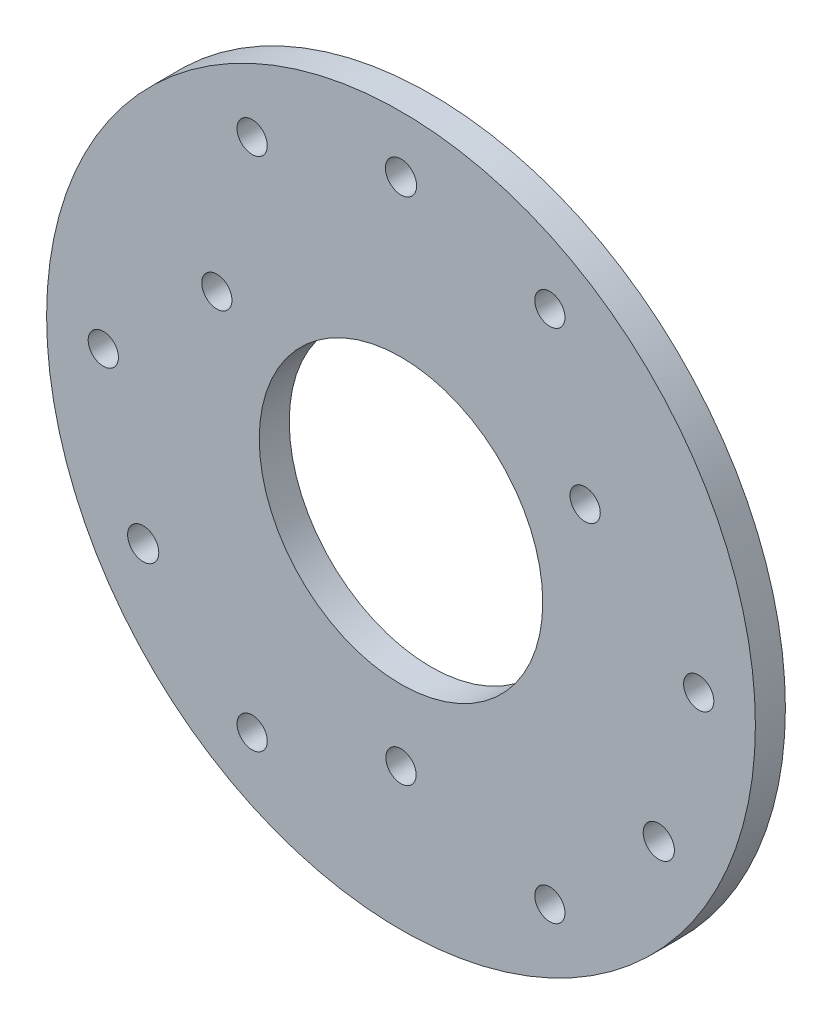
ISO-10303-21;
HEADER;
FILE_DESCRIPTION(('STEP AP214'),'2;1');
FILE_NAME('part.step','',(''),(''),'','','');
FILE_SCHEMA(('AUTOMOTIVE_DESIGN { 1 0 10303 214 1 1 1 1 }'));
ENDSEC;
DATA;
#1=APPLICATION_CONTEXT('core data for automotive mechanical design processes');
#2=APPLICATION_PROTOCOL_DEFINITION('international standard','automotive_design',2000,#1);
#3=PRODUCT_CONTEXT('',#1,'mechanical');
#4=PRODUCT('Part','Part','',(#3));
#5=PRODUCT_RELATED_PRODUCT_CATEGORY('part','',(#4));
#6=PRODUCT_DEFINITION_FORMATION('','',#4);
#7=PRODUCT_DEFINITION_CONTEXT('part definition',#1,'design');
#8=PRODUCT_DEFINITION('design','',#6,#7);
#9=PRODUCT_DEFINITION_SHAPE('','',#8);
#10=(LENGTH_UNIT() NAMED_UNIT(*) SI_UNIT(.MILLI.,.METRE.));
#11=(NAMED_UNIT(*) PLANE_ANGLE_UNIT() SI_UNIT($,.RADIAN.));
#12=(NAMED_UNIT(*) SI_UNIT($,.STERADIAN.) SOLID_ANGLE_UNIT());
#13=UNCERTAINTY_MEASURE_WITH_UNIT(LENGTH_MEASURE(1.E-05),#10,'distance_accuracy_value','');
#14=(GEOMETRIC_REPRESENTATION_CONTEXT(3) GLOBAL_UNCERTAINTY_ASSIGNED_CONTEXT((#13)) GLOBAL_UNIT_ASSIGNED_CONTEXT((#10,
#11,#12)) REPRESENTATION_CONTEXT('',''));
#15=CARTESIAN_POINT('',(0.,0.,0.));
#16=DIRECTION('',(0.,0.,1.));
#17=DIRECTION('',(1.,0.,0.));
#18=AXIS2_PLACEMENT_3D('',#15,#16,#17);
#19=CARTESIAN_POINT('',(0.,0.,4.175));
#20=DIRECTION('',(0.,0.,1.));
#21=DIRECTION('',(1.,0.,0.));
#22=AXIS2_PLACEMENT_3D('',#19,#20,#21);
#23=PLANE('',#22);
#24=CARTESIAN_POINT('',(-15.75,-27.2798002192098,4.175));
#25=DIRECTION('',(0.,0.,1.));
#26=DIRECTION('',(1.,0.,0.));
#27=AXIS2_PLACEMENT_3D('',#24,#25,#26);
#28=CIRCLE('',#27,1.6);
#29=CARTESIAN_POINT('',(-14.15,-27.2798002192098,4.175));
#30=VERTEX_POINT('',#29);
#31=EDGE_CURVE('E53',#30,#30,#28,.T.);
#32=ORIENTED_EDGE('',*,*,#31,.F.);
#33=EDGE_LOOP('',(#32));
#34=FACE_BOUND('',#33,.T.);
#35=CARTESIAN_POINT('',(-31.5,0.,4.175));
#36=DIRECTION('',(0.,0.,1.));
#37=DIRECTION('',(1.,0.,0.));
#38=AXIS2_PLACEMENT_3D('',#35,#36,#37);
#39=CIRCLE('',#38,1.6);
#40=CARTESIAN_POINT('',(-29.9,0.,4.175));
#41=VERTEX_POINT('',#40);
#42=EDGE_CURVE('E140',#41,#41,#39,.T.);
#43=ORIENTED_EDGE('',*,*,#42,.F.);
#44=EDGE_LOOP('',(#43));
#45=FACE_BOUND('',#44,.T.);
#46=CARTESIAN_POINT('',(-15.7499999999998,27.2798002192099,4.175));
#47=DIRECTION('',(0.,0.,1.));
#48=DIRECTION('',(1.,0.,0.));
#49=AXIS2_PLACEMENT_3D('',#46,#47,#48);
#50=CIRCLE('',#49,1.6);
#51=CARTESIAN_POINT('',(-14.1499999999998,27.2798002192099,4.175));
#52=VERTEX_POINT('',#51);
#53=EDGE_CURVE('E144',#52,#52,#50,.T.);
#54=ORIENTED_EDGE('',*,*,#53,.F.);
#55=EDGE_LOOP('',(#54));
#56=FACE_BOUND('',#55,.T.);
#57=CARTESIAN_POINT('',(15.7500000000002,27.2798002192097,4.175));
#58=DIRECTION('',(0.,0.,1.));
#59=DIRECTION('',(1.,0.,0.));
#60=AXIS2_PLACEMENT_3D('',#57,#58,#59);
#61=CIRCLE('',#60,1.6);
#62=CARTESIAN_POINT('',(17.3500000000002,27.2798002192097,4.175));
#63=VERTEX_POINT('',#62);
#64=EDGE_CURVE('E148',#63,#63,#61,.T.);
#65=ORIENTED_EDGE('',*,*,#64,.F.);
#66=EDGE_LOOP('',(#65));
#67=FACE_BOUND('',#66,.T.);
#68=CARTESIAN_POINT('',(31.5,-3.22658566531686E-13,4.175));
#69=DIRECTION('',(0.,0.,1.));
#70=DIRECTION('',(1.,0.,0.));
#71=AXIS2_PLACEMENT_3D('',#68,#69,#70);
#72=CIRCLE('',#71,1.6);
#73=CARTESIAN_POINT('',(33.1,-3.22658566531686E-13,4.175));
#74=VERTEX_POINT('',#73);
#75=EDGE_CURVE('E152',#74,#74,#72,.T.);
#76=ORIENTED_EDGE('',*,*,#75,.F.);
#77=EDGE_LOOP('',(#76));
#78=FACE_BOUND('',#77,.T.);
#79=CARTESIAN_POINT('',(15.75,-27.2798002192098,4.175));
#80=DIRECTION('',(0.,0.,1.));
#81=DIRECTION('',(1.,0.,0.));
#82=AXIS2_PLACEMENT_3D('',#79,#80,#81);
#83=CIRCLE('',#82,1.6);
#84=CARTESIAN_POINT('',(17.35,-27.2798002192098,4.175));
#85=VERTEX_POINT('',#84);
#86=EDGE_CURVE('E156',#85,#85,#83,.T.);
#87=ORIENTED_EDGE('',*,*,#86,.F.);
#88=EDGE_LOOP('',(#87));
#89=FACE_BOUND('',#88,.T.);
#90=CARTESIAN_POINT('',(-19.4855715851498,11.25,4.175));
#91=DIRECTION('',(0.,0.,1.));
#92=DIRECTION('',(1.,0.,0.));
#93=AXIS2_PLACEMENT_3D('',#90,#91,#92);
#94=CIRCLE('',#93,1.6);
#95=CARTESIAN_POINT('',(-17.8855715851498,11.25,4.175));
#96=VERTEX_POINT('',#95);
#97=EDGE_CURVE('E79',#96,#96,#94,.T.);
#98=ORIENTED_EDGE('',*,*,#97,.F.);
#99=EDGE_LOOP('',(#98));
#100=FACE_BOUND('',#99,.T.);
#101=CARTESIAN_POINT('',(0.,-22.5,4.175));
#102=DIRECTION('',(0.,0.,1.));
#103=DIRECTION('',(1.,0.,0.));
#104=AXIS2_PLACEMENT_3D('',#101,#102,#103);
#105=CIRCLE('',#104,1.6);
#106=CARTESIAN_POINT('',(1.59999999999995,-22.5,4.175));
#107=VERTEX_POINT('',#106);
#108=EDGE_CURVE('E91',#107,#107,#105,.T.);
#109=ORIENTED_EDGE('',*,*,#108,.F.);
#110=EDGE_LOOP('',(#109));
#111=FACE_BOUND('',#110,.T.);
#112=CARTESIAN_POINT('',(0.,31.5,4.175));
#113=DIRECTION('',(0.,0.,1.));
#114=DIRECTION('',(1.,0.,0.));
#115=AXIS2_PLACEMENT_3D('',#112,#113,#114);
#116=CIRCLE('',#115,1.65);
#117=CARTESIAN_POINT('',(1.65,31.5,4.175));
#118=VERTEX_POINT('',#117);
#119=EDGE_CURVE('E103',#118,#118,#116,.T.);
#120=ORIENTED_EDGE('',*,*,#119,.F.);
#121=EDGE_LOOP('',(#120));
#122=FACE_BOUND('',#121,.T.);
#123=CARTESIAN_POINT('',(0.,0.,4.175));
#124=DIRECTION('',(0.,0.,1.));
#125=DIRECTION('',(1.,0.,0.));
#126=AXIS2_PLACEMENT_3D('',#123,#124,#125);
#127=CIRCLE('',#126,37.5);
#128=CARTESIAN_POINT('',(37.5,0.,4.175));
#129=VERTEX_POINT('',#128);
#130=EDGE_CURVE('E10',#129,#129,#127,.T.);
#131=ORIENTED_EDGE('',*,*,#130,.T.);
#132=EDGE_LOOP('',(#131));
#133=FACE_BOUND('',#132,.T.);
#134=CARTESIAN_POINT('',(27.2798002192098,-15.75,4.175));
#135=DIRECTION('',(0.,0.,1.));
#136=DIRECTION('',(1.,0.,0.));
#137=AXIS2_PLACEMENT_3D('',#134,#135,#136);
#138=CIRCLE('',#137,1.65);
#139=CARTESIAN_POINT('',(28.9298002192098,-15.75,4.175));
#140=VERTEX_POINT('',#139);
#141=EDGE_CURVE('E43',#140,#140,#138,.T.);
#142=ORIENTED_EDGE('',*,*,#141,.F.);
#143=EDGE_LOOP('',(#142));
#144=FACE_BOUND('',#143,.T.);
#145=CARTESIAN_POINT('',(19.4855715851499,11.25,4.175));
#146=DIRECTION('',(0.,0.,1.));
#147=DIRECTION('',(1.,0.,0.));
#148=AXIS2_PLACEMENT_3D('',#145,#146,#147);
#149=CIRCLE('',#148,1.6);
#150=CARTESIAN_POINT('',(21.0855715851499,11.25,4.175));
#151=VERTEX_POINT('',#150);
#152=EDGE_CURVE('E97',#151,#151,#149,.T.);
#153=ORIENTED_EDGE('',*,*,#152,.F.);
#154=EDGE_LOOP('',(#153));
#155=FACE_BOUND('',#154,.T.);
#156=CARTESIAN_POINT('',(-27.2798002192098,-15.75,4.175));
#157=DIRECTION('',(0.,0.,1.));
#158=DIRECTION('',(1.,0.,0.));
#159=AXIS2_PLACEMENT_3D('',#156,#157,#158);
#160=CIRCLE('',#159,1.65);
#161=CARTESIAN_POINT('',(-25.6298002192098,-15.75,4.175));
#162=VERTEX_POINT('',#161);
#163=EDGE_CURVE('E85',#162,#162,#160,.T.);
#164=ORIENTED_EDGE('',*,*,#163,.F.);
#165=EDGE_LOOP('',(#164));
#166=FACE_BOUND('',#165,.T.);
#167=CARTESIAN_POINT('',(0.,0.,4.175));
#168=DIRECTION('',(0.,0.,1.));
#169=DIRECTION('',(1.,0.,0.));
#170=AXIS2_PLACEMENT_3D('',#167,#168,#169);
#171=CIRCLE('',#170,15.);
#172=CARTESIAN_POINT('',(15.,0.,4.175));
#173=VERTEX_POINT('',#172);
#174=EDGE_CURVE('E70',#173,#173,#171,.T.);
#175=ORIENTED_EDGE('',*,*,#174,.F.);
#176=EDGE_LOOP('',(#175));
#177=FACE_BOUND('',#176,.T.);
#178=ADVANCED_FACE('F30',(#34,#45,#56,#67,#78,#89,#100,#111,#122,#133,#144,#155,#166,#177),#23,.T.);
#179=CARTESIAN_POINT('',(0.,0.,1.));
#180=DIRECTION('',(0.,0.,1.));
#181=DIRECTION('',(1.,0.,0.));
#182=AXIS2_PLACEMENT_3D('',#179,#180,#181);
#183=PLANE('',#182);
#184=CARTESIAN_POINT('',(-15.75,-27.2798002192098,1.));
#185=DIRECTION('',(0.,0.,1.));
#186=DIRECTION('',(1.,0.,0.));
#187=AXIS2_PLACEMENT_3D('',#184,#185,#186);
#188=CIRCLE('',#187,1.6);
#189=CARTESIAN_POINT('',(-14.15,-27.2798002192098,1.));
#190=VERTEX_POINT('',#189);
#191=EDGE_CURVE('E34',#190,#190,#188,.T.);
#192=ORIENTED_EDGE('',*,*,#191,.T.);
#193=EDGE_LOOP('',(#192));
#194=FACE_BOUND('',#193,.T.);
#195=CARTESIAN_POINT('',(-31.5,0.,1.));
#196=DIRECTION('',(0.,0.,1.));
#197=DIRECTION('',(1.,0.,0.));
#198=AXIS2_PLACEMENT_3D('',#195,#196,#197);
#199=CIRCLE('',#198,1.6);
#200=CARTESIAN_POINT('',(-29.9,0.,1.));
#201=VERTEX_POINT('',#200);
#202=EDGE_CURVE('E61',#201,#201,#199,.T.);
#203=ORIENTED_EDGE('',*,*,#202,.T.);
#204=EDGE_LOOP('',(#203));
#205=FACE_BOUND('',#204,.T.);
#206=CARTESIAN_POINT('',(-15.7499999999998,27.2798002192099,1.));
#207=DIRECTION('',(0.,0.,1.));
#208=DIRECTION('',(1.,0.,0.));
#209=AXIS2_PLACEMENT_3D('',#206,#207,#208);
#210=CIRCLE('',#209,1.6);
#211=CARTESIAN_POINT('',(-14.1499999999998,27.2798002192099,1.));
#212=VERTEX_POINT('',#211);
#213=EDGE_CURVE('E59',#212,#212,#210,.T.);
#214=ORIENTED_EDGE('',*,*,#213,.T.);
#215=EDGE_LOOP('',(#214));
#216=FACE_BOUND('',#215,.T.);
#217=CARTESIAN_POINT('',(15.7500000000002,27.2798002192097,1.));
#218=DIRECTION('',(0.,0.,1.));
#219=DIRECTION('',(1.,0.,0.));
#220=AXIS2_PLACEMENT_3D('',#217,#218,#219);
#221=CIRCLE('',#220,1.6);
#222=CARTESIAN_POINT('',(17.3500000000002,27.2798002192097,1.));
#223=VERTEX_POINT('',#222);
#224=EDGE_CURVE('E56',#223,#223,#221,.T.);
#225=ORIENTED_EDGE('',*,*,#224,.T.);
#226=EDGE_LOOP('',(#225));
#227=FACE_BOUND('',#226,.T.);
#228=CARTESIAN_POINT('',(31.5,-3.22658566531686E-13,1.));
#229=DIRECTION('',(0.,0.,1.));
#230=DIRECTION('',(1.,0.,0.));
#231=AXIS2_PLACEMENT_3D('',#228,#229,#230);
#232=CIRCLE('',#231,1.6);
#233=CARTESIAN_POINT('',(33.1,-3.22658566531686E-13,1.));
#234=VERTEX_POINT('',#233);
#235=EDGE_CURVE('E52',#234,#234,#232,.T.);
#236=ORIENTED_EDGE('',*,*,#235,.T.);
#237=EDGE_LOOP('',(#236));
#238=FACE_BOUND('',#237,.T.);
#239=CARTESIAN_POINT('',(15.75,-27.2798002192098,1.));
#240=DIRECTION('',(0.,0.,1.));
#241=DIRECTION('',(1.,0.,0.));
#242=AXIS2_PLACEMENT_3D('',#239,#240,#241);
#243=CIRCLE('',#242,1.6);
#244=CARTESIAN_POINT('',(17.35,-27.2798002192098,1.));
#245=VERTEX_POINT('',#244);
#246=EDGE_CURVE('E49',#245,#245,#243,.T.);
#247=ORIENTED_EDGE('',*,*,#246,.T.);
#248=EDGE_LOOP('',(#247));
#249=FACE_BOUND('',#248,.T.);
#250=CARTESIAN_POINT('',(0.,0.,1.));
#251=DIRECTION('',(0.,0.,1.));
#252=DIRECTION('',(1.,0.,0.));
#253=AXIS2_PLACEMENT_3D('',#250,#251,#252);
#254=CIRCLE('',#253,37.5);
#255=CARTESIAN_POINT('',(37.5,0.,1.));
#256=VERTEX_POINT('',#255);
#257=EDGE_CURVE('E38',#256,#256,#254,.T.);
#258=ORIENTED_EDGE('',*,*,#257,.F.);
#259=EDGE_LOOP('',(#258));
#260=FACE_BOUND('',#259,.T.);
#261=CARTESIAN_POINT('',(27.2798002192098,-15.75,1.));
#262=DIRECTION('',(0.,0.,1.));
#263=DIRECTION('',(1.,0.,0.));
#264=AXIS2_PLACEMENT_3D('',#261,#262,#263);
#265=CIRCLE('',#264,1.65);
#266=CARTESIAN_POINT('',(28.9298002192098,-15.75,1.));
#267=VERTEX_POINT('',#266);
#268=EDGE_CURVE('E46',#267,#267,#265,.T.);
#269=ORIENTED_EDGE('',*,*,#268,.T.);
#270=EDGE_LOOP('',(#269));
#271=FACE_BOUND('',#270,.T.);
#272=CARTESIAN_POINT('',(0.,31.5,1.));
#273=DIRECTION('',(0.,0.,1.));
#274=DIRECTION('',(1.,0.,0.));
#275=AXIS2_PLACEMENT_3D('',#272,#273,#274);
#276=CIRCLE('',#275,1.65);
#277=CARTESIAN_POINT('',(1.65,31.5,1.));
#278=VERTEX_POINT('',#277);
#279=EDGE_CURVE('E100',#278,#278,#276,.T.);
#280=ORIENTED_EDGE('',*,*,#279,.T.);
#281=EDGE_LOOP('',(#280));
#282=FACE_BOUND('',#281,.T.);
#283=CARTESIAN_POINT('',(19.4855715851499,11.25,1.));
#284=DIRECTION('',(0.,0.,1.));
#285=DIRECTION('',(1.,0.,0.));
#286=AXIS2_PLACEMENT_3D('',#283,#284,#285);
#287=CIRCLE('',#286,1.6);
#288=CARTESIAN_POINT('',(21.0855715851499,11.25,1.));
#289=VERTEX_POINT('',#288);
#290=EDGE_CURVE('E94',#289,#289,#287,.T.);
#291=ORIENTED_EDGE('',*,*,#290,.T.);
#292=EDGE_LOOP('',(#291));
#293=FACE_BOUND('',#292,.T.);
#294=CARTESIAN_POINT('',(0.,-22.5,1.));
#295=DIRECTION('',(0.,0.,1.));
#296=DIRECTION('',(1.,0.,0.));
#297=AXIS2_PLACEMENT_3D('',#294,#295,#296);
#298=CIRCLE('',#297,1.6);
#299=CARTESIAN_POINT('',(1.59999999999995,-22.5,1.));
#300=VERTEX_POINT('',#299);
#301=EDGE_CURVE('E88',#300,#300,#298,.T.);
#302=ORIENTED_EDGE('',*,*,#301,.T.);
#303=EDGE_LOOP('',(#302));
#304=FACE_BOUND('',#303,.T.);
#305=CARTESIAN_POINT('',(-27.2798002192098,-15.75,1.));
#306=DIRECTION('',(0.,0.,1.));
#307=DIRECTION('',(1.,0.,0.));
#308=AXIS2_PLACEMENT_3D('',#305,#306,#307);
#309=CIRCLE('',#308,1.65);
#310=CARTESIAN_POINT('',(-25.6298002192098,-15.75,1.));
#311=VERTEX_POINT('',#310);
#312=EDGE_CURVE('E82',#311,#311,#309,.T.);
#313=ORIENTED_EDGE('',*,*,#312,.T.);
#314=EDGE_LOOP('',(#313));
#315=FACE_BOUND('',#314,.T.);
#316=CARTESIAN_POINT('',(-19.4855715851498,11.25,1.));
#317=DIRECTION('',(0.,0.,1.));
#318=DIRECTION('',(1.,0.,0.));
#319=AXIS2_PLACEMENT_3D('',#316,#317,#318);
#320=CIRCLE('',#319,1.6);
#321=CARTESIAN_POINT('',(-17.8855715851498,11.25,1.));
#322=VERTEX_POINT('',#321);
#323=EDGE_CURVE('E75',#322,#322,#320,.T.);
#324=ORIENTED_EDGE('',*,*,#323,.T.);
#325=EDGE_LOOP('',(#324));
#326=FACE_BOUND('',#325,.T.);
#327=CARTESIAN_POINT('',(0.,0.,1.));
#328=DIRECTION('',(0.,0.,1.));
#329=DIRECTION('',(1.,0.,0.));
#330=AXIS2_PLACEMENT_3D('',#327,#328,#329);
#331=CIRCLE('',#330,15.);
#332=CARTESIAN_POINT('',(15.,0.,1.));
#333=VERTEX_POINT('',#332);
#334=EDGE_CURVE('E66',#333,#333,#331,.T.);
#335=ORIENTED_EDGE('',*,*,#334,.T.);
#336=EDGE_LOOP('',(#335));
#337=FACE_BOUND('',#336,.T.);
#338=ADVANCED_FACE('F113',(#194,#205,#216,#227,#238,#249,#260,#271,#282,#293,#304,#315,#326,
#337),#183,.F.);
#339=CARTESIAN_POINT('',(0.,0.,4.175));
#340=DIRECTION('',(0.,0.,-1.));
#341=DIRECTION('',(-1.,0.,0.));
#342=AXIS2_PLACEMENT_3D('',#339,#340,#341);
#343=CYLINDRICAL_SURFACE('',#342,37.5);
#344=ORIENTED_EDGE('',*,*,#130,.F.);
#345=EDGE_LOOP('',(#344));
#346=FACE_BOUND('',#345,.T.);
#347=ORIENTED_EDGE('',*,*,#257,.T.);
#348=EDGE_LOOP('',(#347));
#349=FACE_BOUND('',#348,.T.);
#350=ADVANCED_FACE('F32',(#346,#349),#343,.T.);
#351=CARTESIAN_POINT('',(27.2798002192098,-15.75,4.175));
#352=DIRECTION('',(0.,0.,-1.));
#353=DIRECTION('',(-1.,0.,0.));
#354=AXIS2_PLACEMENT_3D('',#351,#352,#353);
#355=CYLINDRICAL_SURFACE('',#354,1.65);
#356=ORIENTED_EDGE('',*,*,#141,.T.);
#357=EDGE_LOOP('',(#356));
#358=FACE_BOUND('',#357,.T.);
#359=ORIENTED_EDGE('',*,*,#268,.F.);
#360=EDGE_LOOP('',(#359));
#361=FACE_BOUND('',#360,.T.);
#362=ADVANCED_FACE('F116',(#358,#361),#355,.F.);
#363=CARTESIAN_POINT('',(0.,31.5,4.175));
#364=DIRECTION('',(0.,0.,-1.));
#365=DIRECTION('',(-1.,0.,0.));
#366=AXIS2_PLACEMENT_3D('',#363,#364,#365);
#367=CYLINDRICAL_SURFACE('',#366,1.65);
#368=ORIENTED_EDGE('',*,*,#119,.T.);
#369=EDGE_LOOP('',(#368));
#370=FACE_BOUND('',#369,.T.);
#371=ORIENTED_EDGE('',*,*,#279,.F.);
#372=EDGE_LOOP('',(#371));
#373=FACE_BOUND('',#372,.T.);
#374=ADVANCED_FACE('F118',(#370,#373),#367,.F.);
#375=CARTESIAN_POINT('',(19.4855715851499,11.25,4.175));
#376=DIRECTION('',(0.,0.,-1.));
#377=DIRECTION('',(-1.,0.,0.));
#378=AXIS2_PLACEMENT_3D('',#375,#376,#377);
#379=CYLINDRICAL_SURFACE('',#378,1.6);
#380=ORIENTED_EDGE('',*,*,#152,.T.);
#381=EDGE_LOOP('',(#380));
#382=FACE_BOUND('',#381,.T.);
#383=ORIENTED_EDGE('',*,*,#290,.F.);
#384=EDGE_LOOP('',(#383));
#385=FACE_BOUND('',#384,.T.);
#386=ADVANCED_FACE('F124',(#382,#385),#379,.F.);
#387=CARTESIAN_POINT('',(0.,-22.5,4.175));
#388=DIRECTION('',(0.,0.,-1.));
#389=DIRECTION('',(-1.,0.,0.));
#390=AXIS2_PLACEMENT_3D('',#387,#388,#389);
#391=CYLINDRICAL_SURFACE('',#390,1.6);
#392=ORIENTED_EDGE('',*,*,#108,.T.);
#393=EDGE_LOOP('',(#392));
#394=FACE_BOUND('',#393,.T.);
#395=ORIENTED_EDGE('',*,*,#301,.F.);
#396=EDGE_LOOP('',(#395));
#397=FACE_BOUND('',#396,.T.);
#398=ADVANCED_FACE('F190',(#394,#397),#391,.F.);
#399=CARTESIAN_POINT('',(-27.2798002192098,-15.75,4.175));
#400=DIRECTION('',(0.,0.,-1.));
#401=DIRECTION('',(-1.,0.,0.));
#402=AXIS2_PLACEMENT_3D('',#399,#400,#401);
#403=CYLINDRICAL_SURFACE('',#402,1.65);
#404=ORIENTED_EDGE('',*,*,#163,.T.);
#405=EDGE_LOOP('',(#404));
#406=FACE_BOUND('',#405,.T.);
#407=ORIENTED_EDGE('',*,*,#312,.F.);
#408=EDGE_LOOP('',(#407));
#409=FACE_BOUND('',#408,.T.);
#410=ADVANCED_FACE('F183',(#406,#409),#403,.F.);
#411=CARTESIAN_POINT('',(-19.4855715851498,11.25,4.175));
#412=DIRECTION('',(0.,0.,-1.));
#413=DIRECTION('',(-1.,0.,0.));
#414=AXIS2_PLACEMENT_3D('',#411,#412,#413);
#415=CYLINDRICAL_SURFACE('',#414,1.6);
#416=ORIENTED_EDGE('',*,*,#97,.T.);
#417=EDGE_LOOP('',(#416));
#418=FACE_BOUND('',#417,.T.);
#419=ORIENTED_EDGE('',*,*,#323,.F.);
#420=EDGE_LOOP('',(#419));
#421=FACE_BOUND('',#420,.T.);
#422=ADVANCED_FACE('F174',(#418,#421),#415,.F.);
#423=CARTESIAN_POINT('',(0.,0.,4.175));
#424=DIRECTION('',(0.,0.,-1.));
#425=DIRECTION('',(-1.,0.,0.));
#426=AXIS2_PLACEMENT_3D('',#423,#424,#425);
#427=CYLINDRICAL_SURFACE('',#426,15.);
#428=ORIENTED_EDGE('',*,*,#174,.T.);
#429=EDGE_LOOP('',(#428));
#430=FACE_BOUND('',#429,.T.);
#431=ORIENTED_EDGE('',*,*,#334,.F.);
#432=EDGE_LOOP('',(#431));
#433=FACE_BOUND('',#432,.T.);
#434=ADVANCED_FACE('F170',(#430,#433),#427,.F.);
#435=CARTESIAN_POINT('',(15.75,-27.2798002192098,-31.175));
#436=DIRECTION('',(0.,0.,1.));
#437=DIRECTION('',(1.,0.,0.));
#438=AXIS2_PLACEMENT_3D('',#435,#436,#437);
#439=CYLINDRICAL_SURFACE('',#438,1.6);
#440=ORIENTED_EDGE('',*,*,#86,.T.);
#441=EDGE_LOOP('',(#440));
#442=FACE_BOUND('',#441,.T.);
#443=ORIENTED_EDGE('',*,*,#246,.F.);
#444=EDGE_LOOP('',(#443));
#445=FACE_BOUND('',#444,.T.);
#446=ADVANCED_FACE('F173',(#442,#445),#439,.F.);
#447=CARTESIAN_POINT('',(31.5,-3.22658566531686E-13,-31.175));
#448=DIRECTION('',(0.,0.,1.));
#449=DIRECTION('',(1.,0.,0.));
#450=AXIS2_PLACEMENT_3D('',#447,#448,#449);
#451=CYLINDRICAL_SURFACE('',#450,1.6);
#452=ORIENTED_EDGE('',*,*,#75,.T.);
#453=EDGE_LOOP('',(#452));
#454=FACE_BOUND('',#453,.T.);
#455=ORIENTED_EDGE('',*,*,#235,.F.);
#456=EDGE_LOOP('',(#455));
#457=FACE_BOUND('',#456,.T.);
#458=ADVANCED_FACE('F180',(#454,#457),#451,.F.);
#459=CARTESIAN_POINT('',(15.7500000000002,27.2798002192097,-31.175));
#460=DIRECTION('',(0.,0.,1.));
#461=DIRECTION('',(1.,0.,0.));
#462=AXIS2_PLACEMENT_3D('',#459,#460,#461);
#463=CYLINDRICAL_SURFACE('',#462,1.6);
#464=ORIENTED_EDGE('',*,*,#64,.T.);
#465=EDGE_LOOP('',(#464));
#466=FACE_BOUND('',#465,.T.);
#467=ORIENTED_EDGE('',*,*,#224,.F.);
#468=EDGE_LOOP('',(#467));
#469=FACE_BOUND('',#468,.T.);
#470=ADVANCED_FACE('F249',(#466,#469),#463,.F.);
#471=CARTESIAN_POINT('',(-15.7499999999998,27.2798002192099,-31.175));
#472=DIRECTION('',(0.,0.,1.));
#473=DIRECTION('',(1.,0.,0.));
#474=AXIS2_PLACEMENT_3D('',#471,#472,#473);
#475=CYLINDRICAL_SURFACE('',#474,1.6);
#476=ORIENTED_EDGE('',*,*,#53,.T.);
#477=EDGE_LOOP('',(#476));
#478=FACE_BOUND('',#477,.T.);
#479=ORIENTED_EDGE('',*,*,#213,.F.);
#480=EDGE_LOOP('',(#479));
#481=FACE_BOUND('',#480,.T.);
#482=ADVANCED_FACE('F258',(#478,#481),#475,.F.);
#483=CARTESIAN_POINT('',(-31.5,0.,-31.175));
#484=DIRECTION('',(0.,0.,1.));
#485=DIRECTION('',(1.,0.,0.));
#486=AXIS2_PLACEMENT_3D('',#483,#484,#485);
#487=CYLINDRICAL_SURFACE('',#486,1.6);
#488=ORIENTED_EDGE('',*,*,#42,.T.);
#489=EDGE_LOOP('',(#488));
#490=FACE_BOUND('',#489,.T.);
#491=ORIENTED_EDGE('',*,*,#202,.F.);
#492=EDGE_LOOP('',(#491));
#493=FACE_BOUND('',#492,.T.);
#494=ADVANCED_FACE('F268',(#490,#493),#487,.F.);
#495=CARTESIAN_POINT('',(-15.75,-27.2798002192098,-31.175));
#496=DIRECTION('',(0.,0.,1.));
#497=DIRECTION('',(1.,0.,0.));
#498=AXIS2_PLACEMENT_3D('',#495,#496,#497);
#499=CYLINDRICAL_SURFACE('',#498,1.6);
#500=ORIENTED_EDGE('',*,*,#31,.T.);
#501=EDGE_LOOP('',(#500));
#502=FACE_BOUND('',#501,.T.);
#503=ORIENTED_EDGE('',*,*,#191,.F.);
#504=EDGE_LOOP('',(#503));
#505=FACE_BOUND('',#504,.T.);
#506=ADVANCED_FACE('F278',(#502,#505),#499,.F.);
#507=CLOSED_SHELL('',(#178,#338,#350,#362,#374,#386,#398,#410,#422,#434,#446,#458,#470,#482,
#494,#506));
#508=MANIFOLD_SOLID_BREP('B2',#507);
#509=ADVANCED_BREP_SHAPE_REPRESENTATION('',(#18,#508),#14);
#510=SHAPE_DEFINITION_REPRESENTATION(#9,#509);
ENDSEC;
END-ISO-10303-21;
